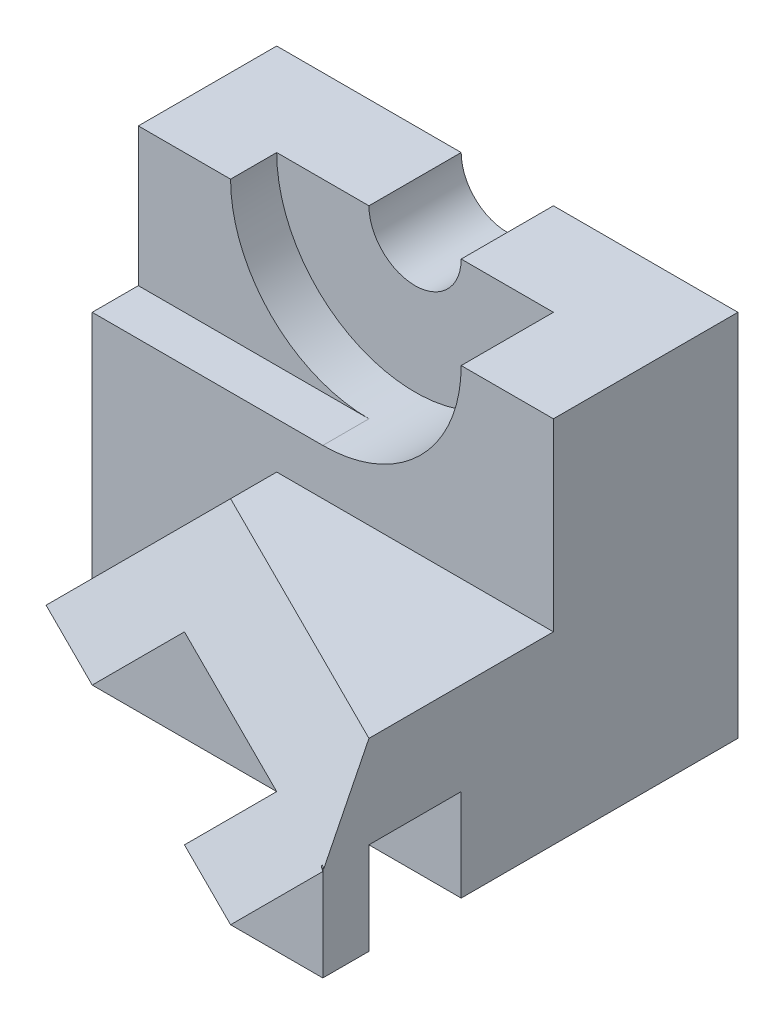
ISO-10303-21;
HEADER;
FILE_DESCRIPTION(('STEP AP214'),'2;1');
FILE_NAME('part.step','',(''),(''),'','','');
FILE_SCHEMA(('AUTOMOTIVE_DESIGN { 1 0 10303 214 1 1 1 1 }'));
ENDSEC;
DATA;
#1=APPLICATION_CONTEXT('core data for automotive mechanical design processes');
#2=APPLICATION_PROTOCOL_DEFINITION('international standard','automotive_design',2000,#1);
#3=PRODUCT_CONTEXT('',#1,'mechanical');
#4=PRODUCT('Part','Part','',(#3));
#5=PRODUCT_RELATED_PRODUCT_CATEGORY('part','',(#4));
#6=PRODUCT_DEFINITION_FORMATION('','',#4);
#7=PRODUCT_DEFINITION_CONTEXT('part definition',#1,'design');
#8=PRODUCT_DEFINITION('design','',#6,#7);
#9=PRODUCT_DEFINITION_SHAPE('','',#8);
#10=(LENGTH_UNIT() NAMED_UNIT(*) SI_UNIT(.MILLI.,.METRE.));
#11=(NAMED_UNIT(*) PLANE_ANGLE_UNIT() SI_UNIT($,.RADIAN.));
#12=(NAMED_UNIT(*) SI_UNIT($,.STERADIAN.) SOLID_ANGLE_UNIT());
#13=UNCERTAINTY_MEASURE_WITH_UNIT(LENGTH_MEASURE(1.E-05),#10,'distance_accuracy_value','');
#14=(GEOMETRIC_REPRESENTATION_CONTEXT(3) GLOBAL_UNCERTAINTY_ASSIGNED_CONTEXT((#13)) GLOBAL_UNIT_ASSIGNED_CONTEXT((#10,
#11,#12)) REPRESENTATION_CONTEXT('',''));
#15=CARTESIAN_POINT('',(0.,0.,0.));
#16=DIRECTION('',(0.,0.,1.));
#17=DIRECTION('',(1.,0.,0.));
#18=AXIS2_PLACEMENT_3D('',#15,#16,#17);
#19=CARTESIAN_POINT('',(0.,0.,90.));
#20=DIRECTION('',(0.,1.,0.));
#21=DIRECTION('',(0.,0.,1.));
#22=AXIS2_PLACEMENT_3D('',#19,#20,#21);
#23=PLANE('',#22);
#24=DIRECTION('',(1.,0.,0.));
#25=VECTOR('',#24,1.);
#26=CARTESIAN_POINT('',(0.,0.,0.));
#27=LINE('',#26,#25);
#28=CARTESIAN_POINT('',(0.,0.,0.));
#29=VERTEX_POINT('',#28);
#30=CARTESIAN_POINT('',(100.,0.,0.));
#31=VERTEX_POINT('',#30);
#32=EDGE_CURVE('E230',#29,#31,#27,.T.);
#33=ORIENTED_EDGE('',*,*,#32,.T.);
#34=DIRECTION('',(0.,0.,-1.));
#35=VECTOR('',#34,1.);
#36=CARTESIAN_POINT('',(100.,0.,90.));
#37=LINE('',#36,#35);
#38=CARTESIAN_POINT('',(100.,0.,60.));
#39=VERTEX_POINT('',#38);
#40=EDGE_CURVE('E292',#39,#31,#37,.T.);
#41=ORIENTED_EDGE('',*,*,#40,.F.);
#42=DIRECTION('',(1.,0.,0.));
#43=VECTOR('',#42,1.);
#44=CARTESIAN_POINT('',(20.,0.,60.));
#45=LINE('',#44,#43);
#46=CARTESIAN_POINT('',(20.,0.,60.));
#47=VERTEX_POINT('',#46);
#48=EDGE_CURVE('E213',#47,#39,#45,.T.);
#49=ORIENTED_EDGE('',*,*,#48,.F.);
#50=DIRECTION('',(-0.894427190999916,0.,-0.447213595499958));
#51=VECTOR('',#50,1.);
#52=CARTESIAN_POINT('',(0.,0.,50.));
#53=LINE('',#52,#51);
#54=CARTESIAN_POINT('',(0.,0.,50.));
#55=VERTEX_POINT('',#54);
#56=EDGE_CURVE('E227',#47,#55,#53,.T.);
#57=ORIENTED_EDGE('',*,*,#56,.T.);
#58=DIRECTION('',(0.,0.,-1.));
#59=VECTOR('',#58,1.);
#60=CARTESIAN_POINT('',(0.,0.,90.));
#61=LINE('',#60,#59);
#62=CARTESIAN_POINT('',(0.,0.,40.));
#63=VERTEX_POINT('',#62);
#64=EDGE_CURVE('E229',#55,#63,#61,.T.);
#65=ORIENTED_EDGE('',*,*,#64,.T.);
#66=EDGE_CURVE('E183',#63,#29,#61,.T.);
#67=ORIENTED_EDGE('',*,*,#66,.T.);
#68=EDGE_LOOP('',(#33,#41,#49,#57,#65,#67));
#69=FACE_BOUND('',#68,.T.);
#70=ADVANCED_FACE('F33',(#69),#23,.F.);
#71=CARTESIAN_POINT('',(20.,0.,50.));
#72=DIRECTION('',(-0.447213595499958,0.,0.894427190999916));
#73=DIRECTION('',(0.894427190999916,0.,0.447213595499958));
#74=AXIS2_PLACEMENT_3D('',#71,#72,#73);
#75=PLANE('',#74);
#76=DIRECTION('',(0.894427190999916,0.,0.447213595499958));
#77=VECTOR('',#76,1.);
#78=CARTESIAN_POINT('',(20.,20.5,50.));
#79=LINE('',#78,#77);
#80=CARTESIAN_POINT('',(99.2916666666667,20.5,89.6458333333334));
#81=VERTEX_POINT('',#80);
#82=CARTESIAN_POINT('',(100.,20.5,90.));
#83=VERTEX_POINT('',#82);
#84=EDGE_CURVE('E159',#81,#83,#79,.T.);
#85=ORIENTED_EDGE('',*,*,#84,.F.);
#86=DIRECTION('',(0.75630289061022,-0.533860863960155,0.37815144530511));
#87=VECTOR('',#86,1.);
#88=CARTESIAN_POINT('',(50.8758040573973,54.6759030183078,65.4379020286986));
#89=LINE('',#88,#87);
#90=CARTESIAN_POINT('',(100.,20.0000000000002,90.));
#91=VERTEX_POINT('',#90);
#92=EDGE_CURVE('E50',#81,#91,#89,.T.);
#93=ORIENTED_EDGE('',*,*,#92,.T.);
#94=DIRECTION('',(0.,-1.,0.));
#95=VECTOR('',#94,1.);
#96=CARTESIAN_POINT('',(100.,20.5,90.));
#97=LINE('',#96,#95);
#98=EDGE_CURVE('E167',#83,#91,#97,.T.);
#99=ORIENTED_EDGE('',*,*,#98,.F.);
#100=EDGE_LOOP('',(#85,#93,#99));
#101=FACE_BOUND('',#100,.T.);
#102=ADVANCED_FACE('F168',(#101),#75,.T.);
#103=CARTESIAN_POINT('',(0.,20.5,0.));
#104=DIRECTION('',(0.,-1.,0.));
#105=DIRECTION('',(0.,0.,-1.));
#106=AXIS2_PLACEMENT_3D('',#103,#104,#105);
#107=PLANE('',#106);
#108=DIRECTION('',(0.,0.,-1.));
#109=VECTOR('',#108,1.);
#110=CARTESIAN_POINT('',(100.,20.5,90.));
#111=LINE('',#110,#109);
#112=CARTESIAN_POINT('',(100.,20.5,89.7500000000001));
#113=VERTEX_POINT('',#112);
#114=EDGE_CURVE('E162',#83,#113,#111,.T.);
#115=ORIENTED_EDGE('',*,*,#114,.T.);
#116=DIRECTION('',(-0.894427190999916,0.,-0.447213595499958));
#117=VECTOR('',#116,1.);
#118=CARTESIAN_POINT('',(-15.9,20.5,31.8));
#119=LINE('',#118,#117);
#120=CARTESIAN_POINT('',(99.2500000000001,20.4999999999999,89.3750000000001));
#121=VERTEX_POINT('',#120);
#122=EDGE_CURVE('E165',#113,#121,#119,.T.);
#123=ORIENTED_EDGE('',*,*,#122,.T.);
#124=DIRECTION('',(-0.152057184253942,0.,-0.988371697650617));
#125=VECTOR('',#124,1.);
#126=CARTESIAN_POINT('',(83.5231213872832,20.5,-12.849710982659));
#127=LINE('',#126,#125);
#128=EDGE_CURVE('E11',#81,#121,#127,.T.);
#129=ORIENTED_EDGE('',*,*,#128,.F.);
#130=ORIENTED_EDGE('',*,*,#84,.T.);
#131=EDGE_LOOP('',(#115,#123,#129,#130));
#132=FACE_BOUND('',#131,.T.);
#133=ADVANCED_FACE('F35',(#132),#107,.F.);
#134=DIRECTION('',(1.,0.,0.));
#135=VECTOR('',#134,1.);
#136=CARTESIAN_POINT('',(60.,0.,80.));
#137=LINE('',#136,#135);
#138=CARTESIAN_POINT('',(60.,0.,80.));
#139=VERTEX_POINT('',#138);
#140=CARTESIAN_POINT('',(100.,0.,80.));
#141=VERTEX_POINT('',#140);
#142=EDGE_CURVE('E164',#139,#141,#137,.T.);
#143=ORIENTED_EDGE('',*,*,#142,.T.);
#144=CARTESIAN_POINT('',(100.,0.,90.));
#145=VERTEX_POINT('',#144);
#146=EDGE_CURVE('E172',#145,#141,#37,.T.);
#147=ORIENTED_EDGE('',*,*,#146,.F.);
#148=DIRECTION('',(1.,0.,0.));
#149=VECTOR('',#148,1.);
#150=CARTESIAN_POINT('',(60.,0.,90.));
#151=LINE('',#150,#149);
#152=CARTESIAN_POINT('',(80.,0.,90.0000000000001));
#153=VERTEX_POINT('',#152);
#154=EDGE_CURVE('E210',#153,#145,#151,.T.);
#155=ORIENTED_EDGE('',*,*,#154,.F.);
#156=DIRECTION('',(0.894427190999916,0.,0.447213595499958));
#157=VECTOR('',#156,1.);
#158=CARTESIAN_POINT('',(60.,0.,80.));
#159=LINE('',#158,#157);
#160=EDGE_CURVE('E197',#139,#153,#159,.T.);
#161=ORIENTED_EDGE('',*,*,#160,.F.);
#162=EDGE_LOOP('',(#143,#147,#155,#161));
#163=FACE_BOUND('',#162,.T.);
#164=ADVANCED_FACE('F384',(#163),#23,.F.);
#165=CARTESIAN_POINT('',(60.,20.,90.));
#166=DIRECTION('',(0.,0.,1.));
#167=DIRECTION('',(1.,0.,0.));
#168=AXIS2_PLACEMENT_3D('',#165,#166,#167);
#169=PLANE('',#168);
#170=DIRECTION('',(0.,1.,0.));
#171=VECTOR('',#170,1.);
#172=CARTESIAN_POINT('',(100.,0.,90.));
#173=LINE('',#172,#171);
#174=EDGE_CURVE('E211',#145,#91,#173,.T.);
#175=ORIENTED_EDGE('',*,*,#174,.T.);
#176=DIRECTION('',(-0.707106781186547,-0.707106781186548,0.));
#177=VECTOR('',#176,1.);
#178=CARTESIAN_POINT('',(80.,0.,90.0000000000001));
#179=LINE('',#178,#177);
#180=EDGE_CURVE('E208',#91,#153,#179,.T.);
#181=ORIENTED_EDGE('',*,*,#180,.T.);
#182=ORIENTED_EDGE('',*,*,#154,.T.);
#183=EDGE_LOOP('',(#175,#181,#182));
#184=FACE_BOUND('',#183,.T.);
#185=ADVANCED_FACE('F390',(#184),#169,.T.);
#186=CARTESIAN_POINT('',(0.,0.,90.));
#187=DIRECTION('',(1.,0.,0.));
#188=DIRECTION('',(0.,0.,-1.));
#189=AXIS2_PLACEMENT_3D('',#186,#187,#188);
#190=PLANE('',#189);
#191=ORIENTED_EDGE('',*,*,#66,.F.);
#192=DIRECTION('',(0.,-1.,0.));
#193=VECTOR('',#192,1.);
#194=CARTESIAN_POINT('',(0.,80.,40.));
#195=LINE('',#194,#193);
#196=CARTESIAN_POINT('',(0.,50.,40.));
#197=VERTEX_POINT('',#196);
#198=EDGE_CURVE('E242',#197,#63,#195,.T.);
#199=ORIENTED_EDGE('',*,*,#198,.F.);
#200=DIRECTION('',(0.,0.,1.));
#201=VECTOR('',#200,1.);
#202=CARTESIAN_POINT('',(0.,50.,30.));
#203=LINE('',#202,#201);
#204=CARTESIAN_POINT('',(0.,50.,30.));
#205=VERTEX_POINT('',#204);
#206=EDGE_CURVE('E248',#205,#197,#203,.T.);
#207=ORIENTED_EDGE('',*,*,#206,.F.);
#208=DIRECTION('',(0.,-1.,0.));
#209=VECTOR('',#208,1.);
#210=CARTESIAN_POINT('',(0.,50.,30.));
#211=LINE('',#210,#209);
#212=CARTESIAN_POINT('',(0.,80.,30.));
#213=VERTEX_POINT('',#212);
#214=EDGE_CURVE('E250',#213,#205,#211,.T.);
#215=ORIENTED_EDGE('',*,*,#214,.F.);
#216=DIRECTION('',(0.,0.,-1.));
#217=VECTOR('',#216,1.);
#218=CARTESIAN_POINT('',(0.,80.,90.));
#219=LINE('',#218,#217);
#220=CARTESIAN_POINT('',(0.,80.,0.));
#221=VERTEX_POINT('',#220);
#222=EDGE_CURVE('E296',#213,#221,#219,.T.);
#223=ORIENTED_EDGE('',*,*,#222,.T.);
#224=DIRECTION('',(0.,-1.,0.));
#225=VECTOR('',#224,1.);
#226=CARTESIAN_POINT('',(0.,0.,0.));
#227=LINE('',#226,#225);
#228=EDGE_CURVE('E37',#221,#29,#227,.T.);
#229=ORIENTED_EDGE('',*,*,#228,.T.);
#230=EDGE_LOOP('',(#191,#199,#207,#215,#223,#229));
#231=FACE_BOUND('',#230,.T.);
#232=ADVANCED_FACE('F351',(#231),#190,.F.);
#233=CARTESIAN_POINT('',(100.,40.,130.));
#234=DIRECTION('',(0.,1.,0.));
#235=DIRECTION('',(0.,0.,1.));
#236=AXIS2_PLACEMENT_3D('',#233,#234,#235);
#237=PLANE('',#236);
#238=DIRECTION('',(0.,0.,-1.));
#239=VECTOR('',#238,1.);
#240=CARTESIAN_POINT('',(40.,40.,134.));
#241=LINE('',#240,#239);
#242=CARTESIAN_POINT('',(40.,40.,50.));
#243=VERTEX_POINT('',#242);
#244=CARTESIAN_POINT('',(40.,40.,40.));
#245=VERTEX_POINT('',#244);
#246=EDGE_CURVE('E234',#243,#245,#241,.T.);
#247=ORIENTED_EDGE('',*,*,#246,.F.);
#248=DIRECTION('',(0.894427190999916,0.,0.447213595499958));
#249=VECTOR('',#248,1.);
#250=CARTESIAN_POINT('',(100.,40.,80.));
#251=LINE('',#250,#249);
#252=CARTESIAN_POINT('',(100.,40.,80.));
#253=VERTEX_POINT('',#252);
#254=EDGE_CURVE('E235',#243,#253,#251,.T.);
#255=ORIENTED_EDGE('',*,*,#254,.T.);
#256=DIRECTION('',(0.,0.,-1.));
#257=VECTOR('',#256,1.);
#258=CARTESIAN_POINT('',(100.,40.,130.));
#259=LINE('',#258,#257);
#260=CARTESIAN_POINT('',(100.,40.,40.));
#261=VERTEX_POINT('',#260);
#262=EDGE_CURVE('E237',#253,#261,#259,.T.);
#263=ORIENTED_EDGE('',*,*,#262,.T.);
#264=DIRECTION('',(1.,0.,0.));
#265=VECTOR('',#264,1.);
#266=CARTESIAN_POINT('',(100.,40.,40.));
#267=LINE('',#266,#265);
#268=EDGE_CURVE('E241',#245,#261,#267,.T.);
#269=ORIENTED_EDGE('',*,*,#268,.F.);
#270=EDGE_LOOP('',(#247,#255,#263,#269));
#271=FACE_BOUND('',#270,.T.);
#272=ADVANCED_FACE('F367',(#271),#237,.T.);
#273=CARTESIAN_POINT('',(0.,80.,90.));
#274=DIRECTION('',(0.,-1.,0.));
#275=DIRECTION('',(0.,0.,-1.));
#276=AXIS2_PLACEMENT_3D('',#273,#274,#275);
#277=PLANE('',#276);
#278=DIRECTION('',(-1.,0.,0.));
#279=VECTOR('',#278,1.);
#280=CARTESIAN_POINT('',(0.,80.,30.));
#281=LINE('',#280,#279);
#282=CARTESIAN_POINT('',(20.,79.9999999999998,30.));
#283=VERTEX_POINT('',#282);
#284=EDGE_CURVE('E247',#283,#213,#281,.T.);
#285=ORIENTED_EDGE('',*,*,#284,.F.);
#286=DIRECTION('',(0.,0.,-1.));
#287=VECTOR('',#286,1.);
#288=CARTESIAN_POINT('',(20.,80.,110.));
#289=LINE('',#288,#287);
#290=CARTESIAN_POINT('',(20.,80.,20.));
#291=VERTEX_POINT('',#290);
#292=EDGE_CURVE('E270',#283,#291,#289,.T.);
#293=ORIENTED_EDGE('',*,*,#292,.T.);
#294=DIRECTION('',(-1.,0.,0.));
#295=VECTOR('',#294,1.);
#296=CARTESIAN_POINT('',(20.,80.,20.));
#297=LINE('',#296,#295);
#298=CARTESIAN_POINT('',(40.,80.,20.));
#299=VERTEX_POINT('',#298);
#300=EDGE_CURVE('E274',#299,#291,#297,.T.);
#301=ORIENTED_EDGE('',*,*,#300,.F.);
#302=DIRECTION('',(0.,0.,-1.));
#303=VECTOR('',#302,1.);
#304=CARTESIAN_POINT('',(40.,80.,90.));
#305=LINE('',#304,#303);
#306=CARTESIAN_POINT('',(40.,80.,0.));
#307=VERTEX_POINT('',#306);
#308=EDGE_CURVE('E277',#299,#307,#305,.T.);
#309=ORIENTED_EDGE('',*,*,#308,.T.);
#310=DIRECTION('',(-1.,0.,0.));
#311=VECTOR('',#310,1.);
#312=CARTESIAN_POINT('',(0.,80.,0.));
#313=LINE('',#312,#311);
#314=EDGE_CURVE('E173',#307,#221,#313,.T.);
#315=ORIENTED_EDGE('',*,*,#314,.T.);
#316=ORIENTED_EDGE('',*,*,#222,.F.);
#317=EDGE_LOOP('',(#285,#293,#301,#309,#315,#316));
#318=FACE_BOUND('',#317,.T.);
#319=ADVANCED_FACE('F329',(#318),#277,.F.);
#320=CARTESIAN_POINT('',(100.,0.,90.));
#321=DIRECTION('',(-1.,0.,0.));
#322=DIRECTION('',(0.,0.,1.));
#323=AXIS2_PLACEMENT_3D('',#320,#321,#322);
#324=PLANE('',#323);
#325=DIRECTION('',(0.,-1.,0.));
#326=VECTOR('',#325,1.);
#327=CARTESIAN_POINT('',(100.,19.999,80.));
#328=LINE('',#327,#326);
#329=CARTESIAN_POINT('',(100.,20.,80.));
#330=VERTEX_POINT('',#329);
#331=EDGE_CURVE('E43',#330,#141,#328,.T.);
#332=ORIENTED_EDGE('',*,*,#331,.F.);
#333=DIRECTION('',(0.,0.,1.));
#334=VECTOR('',#333,1.);
#335=CARTESIAN_POINT('',(100.,20.,80.));
#336=LINE('',#335,#334);
#337=CARTESIAN_POINT('',(100.,20.,60.));
#338=VERTEX_POINT('',#337);
#339=EDGE_CURVE('E403',#338,#330,#336,.T.);
#340=ORIENTED_EDGE('',*,*,#339,.F.);
#341=DIRECTION('',(0.,1.,0.));
#342=VECTOR('',#341,1.);
#343=CARTESIAN_POINT('',(100.,19.999,60.));
#344=LINE('',#343,#342);
#345=EDGE_CURVE('E188',#39,#338,#344,.T.);
#346=ORIENTED_EDGE('',*,*,#345,.F.);
#347=ORIENTED_EDGE('',*,*,#40,.T.);
#348=DIRECTION('',(0.,1.,0.));
#349=VECTOR('',#348,1.);
#350=CARTESIAN_POINT('',(100.,0.,0.));
#351=LINE('',#350,#349);
#352=CARTESIAN_POINT('',(100.,80.,0.));
#353=VERTEX_POINT('',#352);
#354=EDGE_CURVE('E289',#31,#353,#351,.T.);
#355=ORIENTED_EDGE('',*,*,#354,.T.);
#356=DIRECTION('',(0.,0.,-1.));
#357=VECTOR('',#356,1.);
#358=CARTESIAN_POINT('',(100.,80.,90.));
#359=LINE('',#358,#357);
#360=CARTESIAN_POINT('',(100.,80.,40.));
#361=VERTEX_POINT('',#360);
#362=EDGE_CURVE('E291',#361,#353,#359,.T.);
#363=ORIENTED_EDGE('',*,*,#362,.F.);
#364=DIRECTION('',(0.,1.,0.));
#365=VECTOR('',#364,1.);
#366=CARTESIAN_POINT('',(100.,80.,40.));
#367=LINE('',#366,#365);
#368=EDGE_CURVE('E263',#261,#361,#367,.T.);
#369=ORIENTED_EDGE('',*,*,#368,.F.);
#370=ORIENTED_EDGE('',*,*,#262,.F.);
#371=DIRECTION('',(0.,0.894427190999916,-0.447213595499959));
#372=VECTOR('',#371,1.);
#373=CARTESIAN_POINT('',(100.,40.,80.));
#374=LINE('',#373,#372);
#375=EDGE_CURVE('E179',#113,#253,#374,.T.);
#376=ORIENTED_EDGE('',*,*,#375,.F.);
#377=ORIENTED_EDGE('',*,*,#114,.F.);
#378=ORIENTED_EDGE('',*,*,#98,.T.);
#379=ORIENTED_EDGE('',*,*,#174,.F.);
#380=ORIENTED_EDGE('',*,*,#146,.T.);
#381=EDGE_LOOP('',(#332,#340,#346,#347,#355,#363,#369,#370,#376,#377,#378,#379,#380));
#382=FACE_BOUND('',#381,.T.);
#383=ADVANCED_FACE('F176',(#382),#324,.F.);
#384=DIRECTION('',(0.,0.,-1.));
#385=VECTOR('',#384,1.);
#386=CARTESIAN_POINT('',(80.,80.,110.));
#387=LINE('',#386,#385);
#388=CARTESIAN_POINT('',(80.,80.,40.));
#389=VERTEX_POINT('',#388);
#390=CARTESIAN_POINT('',(80.,80.,20.));
#391=VERTEX_POINT('',#390);
#392=EDGE_CURVE('E260',#389,#391,#387,.T.);
#393=ORIENTED_EDGE('',*,*,#392,.F.);
#394=DIRECTION('',(-1.,0.,0.));
#395=VECTOR('',#394,1.);
#396=CARTESIAN_POINT('',(100.,80.,40.));
#397=LINE('',#396,#395);
#398=EDGE_CURVE('E256',#361,#389,#397,.T.);
#399=ORIENTED_EDGE('',*,*,#398,.F.);
#400=ORIENTED_EDGE('',*,*,#362,.T.);
#401=CARTESIAN_POINT('',(60.,80.,0.));
#402=VERTEX_POINT('',#401);
#403=EDGE_CURVE('E293',#353,#402,#313,.T.);
#404=ORIENTED_EDGE('',*,*,#403,.T.);
#405=DIRECTION('',(0.,0.,-1.));
#406=VECTOR('',#405,1.);
#407=CARTESIAN_POINT('',(60.,80.,90.));
#408=LINE('',#407,#406);
#409=CARTESIAN_POINT('',(60.,80.,20.));
#410=VERTEX_POINT('',#409);
#411=EDGE_CURVE('E282',#410,#402,#408,.T.);
#412=ORIENTED_EDGE('',*,*,#411,.F.);
#413=EDGE_CURVE('E261',#391,#410,#297,.T.);
#414=ORIENTED_EDGE('',*,*,#413,.F.);
#415=EDGE_LOOP('',(#393,#399,#400,#404,#412,#414));
#416=FACE_BOUND('',#415,.T.);
#417=ADVANCED_FACE('F315',(#416),#277,.F.);
#418=CARTESIAN_POINT('',(0.,0.,0.));
#419=DIRECTION('',(0.,0.,-1.));
#420=DIRECTION('',(-1.,0.,0.));
#421=AXIS2_PLACEMENT_3D('',#418,#419,#420);
#422=PLANE('',#421);
#423=ORIENTED_EDGE('',*,*,#403,.F.);
#424=ORIENTED_EDGE('',*,*,#354,.F.);
#425=ORIENTED_EDGE('',*,*,#32,.F.);
#426=ORIENTED_EDGE('',*,*,#228,.F.);
#427=ORIENTED_EDGE('',*,*,#314,.F.);
#428=CARTESIAN_POINT('',(50.,80.,0.));
#429=DIRECTION('',(0.,0.,-1.));
#430=DIRECTION('',(-1.,0.,0.));
#431=AXIS2_PLACEMENT_3D('',#428,#429,#430);
#432=CIRCLE('',#431,10.);
#433=EDGE_CURVE('E279',#402,#307,#432,.T.);
#434=ORIENTED_EDGE('',*,*,#433,.F.);
#435=EDGE_LOOP('',(#423,#424,#425,#426,#427,#434));
#436=FACE_BOUND('',#435,.T.);
#437=ADVANCED_FACE('F321',(#436),#422,.T.);
#438=CARTESIAN_POINT('',(50.,80.,90.));
#439=DIRECTION('',(0.,0.,-1.));
#440=DIRECTION('',(-1.,0.,0.));
#441=AXIS2_PLACEMENT_3D('',#438,#439,#440);
#442=CYLINDRICAL_SURFACE('',#441,10.);
#443=ORIENTED_EDGE('',*,*,#308,.F.);
#444=CARTESIAN_POINT('',(50.,80.,20.));
#445=DIRECTION('',(0.,0.,-1.));
#446=DIRECTION('',(-1.,0.,0.));
#447=AXIS2_PLACEMENT_3D('',#444,#445,#446);
#448=CIRCLE('',#447,10.);
#449=EDGE_CURVE('E284',#299,#410,#448,.F.);
#450=ORIENTED_EDGE('',*,*,#449,.T.);
#451=ORIENTED_EDGE('',*,*,#411,.T.);
#452=ORIENTED_EDGE('',*,*,#433,.T.);
#453=EDGE_LOOP('',(#443,#450,#451,#452));
#454=FACE_BOUND('',#453,.T.);
#455=ADVANCED_FACE('F307',(#454),#442,.F.);
#456=CARTESIAN_POINT('',(50.,80.,20.));
#457=DIRECTION('',(0.,0.,-1.));
#458=DIRECTION('',(-1.,0.,0.));
#459=AXIS2_PLACEMENT_3D('',#456,#457,#458);
#460=PLANE('',#459);
#461=ORIENTED_EDGE('',*,*,#300,.T.);
#462=CARTESIAN_POINT('',(50.,80.,20.));
#463=DIRECTION('',(0.,0.,1.));
#464=DIRECTION('',(-1.,0.,0.));
#465=AXIS2_PLACEMENT_3D('',#462,#463,#464);
#466=CIRCLE('',#465,30.);
#467=EDGE_CURVE('E271',#291,#391,#466,.T.);
#468=ORIENTED_EDGE('',*,*,#467,.T.);
#469=ORIENTED_EDGE('',*,*,#413,.T.);
#470=ORIENTED_EDGE('',*,*,#449,.F.);
#471=EDGE_LOOP('',(#461,#468,#469,#470));
#472=FACE_BOUND('',#471,.T.);
#473=ADVANCED_FACE('F332',(#472),#460,.F.);
#474=CARTESIAN_POINT('',(50.,80.,110.));
#475=DIRECTION('',(0.,0.,-1.));
#476=DIRECTION('',(-1.,0.,0.));
#477=AXIS2_PLACEMENT_3D('',#474,#475,#476);
#478=CYLINDRICAL_SURFACE('',#477,30.);
#479=DIRECTION('',(0.,0.,1.));
#480=VECTOR('',#479,1.);
#481=CARTESIAN_POINT('',(50.0000000000002,50.,30.));
#482=LINE('',#481,#480);
#483=CARTESIAN_POINT('',(50.0000000000002,50.,30.));
#484=VERTEX_POINT('',#483);
#485=CARTESIAN_POINT('',(50.0000000000002,50.,40.));
#486=VERTEX_POINT('',#485);
#487=EDGE_CURVE('E257',#484,#486,#482,.T.);
#488=ORIENTED_EDGE('',*,*,#487,.T.);
#489=CARTESIAN_POINT('',(50.,80.,40.));
#490=DIRECTION('',(0.,0.,-1.));
#491=DIRECTION('',(-1.,0.,0.));
#492=AXIS2_PLACEMENT_3D('',#489,#490,#491);
#493=CIRCLE('',#492,30.);
#494=EDGE_CURVE('E206',#389,#486,#493,.T.);
#495=ORIENTED_EDGE('',*,*,#494,.F.);
#496=ORIENTED_EDGE('',*,*,#392,.T.);
#497=ORIENTED_EDGE('',*,*,#467,.F.);
#498=ORIENTED_EDGE('',*,*,#292,.F.);
#499=CARTESIAN_POINT('',(50.,80.,30.));
#500=DIRECTION('',(0.,0.,-1.));
#501=DIRECTION('',(1.,0.,0.));
#502=AXIS2_PLACEMENT_3D('',#499,#500,#501);
#503=CIRCLE('',#502,30.);
#504=EDGE_CURVE('E245',#484,#283,#503,.T.);
#505=ORIENTED_EDGE('',*,*,#504,.F.);
#506=EDGE_LOOP('',(#488,#495,#496,#497,#498,#505));
#507=FACE_BOUND('',#506,.T.);
#508=ADVANCED_FACE('F334',(#507),#478,.F.);
#509=CARTESIAN_POINT('',(0.,0.,40.));
#510=DIRECTION('',(0.,0.,-1.));
#511=DIRECTION('',(-1.,0.,0.));
#512=AXIS2_PLACEMENT_3D('',#509,#510,#511);
#513=PLANE('',#512);
#514=ORIENTED_EDGE('',*,*,#494,.T.);
#515=DIRECTION('',(1.,0.,0.));
#516=VECTOR('',#515,1.);
#517=CARTESIAN_POINT('',(50.0000000000002,50.,40.));
#518=LINE('',#517,#516);
#519=EDGE_CURVE('E254',#197,#486,#518,.T.);
#520=ORIENTED_EDGE('',*,*,#519,.F.);
#521=ORIENTED_EDGE('',*,*,#198,.T.);
#522=DIRECTION('',(0.707106781186548,0.707106781186547,0.));
#523=VECTOR('',#522,1.);
#524=CARTESIAN_POINT('',(40.,40.,40.));
#525=LINE('',#524,#523);
#526=EDGE_CURVE('E238',#63,#245,#525,.T.);
#527=ORIENTED_EDGE('',*,*,#526,.T.);
#528=ORIENTED_EDGE('',*,*,#268,.T.);
#529=ORIENTED_EDGE('',*,*,#368,.T.);
#530=ORIENTED_EDGE('',*,*,#398,.T.);
#531=EDGE_LOOP('',(#514,#520,#521,#527,#528,#529,#530));
#532=FACE_BOUND('',#531,.T.);
#533=ADVANCED_FACE('F360',(#532),#513,.F.);
#534=CARTESIAN_POINT('',(50.0000000000002,50.,30.));
#535=DIRECTION('',(0.,-1.,0.));
#536=DIRECTION('',(0.,0.,-1.));
#537=AXIS2_PLACEMENT_3D('',#534,#535,#536);
#538=PLANE('',#537);
#539=ORIENTED_EDGE('',*,*,#519,.T.);
#540=ORIENTED_EDGE('',*,*,#487,.F.);
#541=DIRECTION('',(1.,0.,0.));
#542=VECTOR('',#541,1.);
#543=CARTESIAN_POINT('',(50.0000000000002,50.,30.));
#544=LINE('',#543,#542);
#545=EDGE_CURVE('E244',#205,#484,#544,.T.);
#546=ORIENTED_EDGE('',*,*,#545,.F.);
#547=ORIENTED_EDGE('',*,*,#206,.T.);
#548=EDGE_LOOP('',(#539,#540,#546,#547));
#549=FACE_BOUND('',#548,.T.);
#550=ADVANCED_FACE('F358',(#549),#538,.F.);
#551=CARTESIAN_POINT('',(50.,80.,30.));
#552=DIRECTION('',(0.,0.,1.));
#553=DIRECTION('',(1.,0.,0.));
#554=AXIS2_PLACEMENT_3D('',#551,#552,#553);
#555=PLANE('',#554);
#556=ORIENTED_EDGE('',*,*,#504,.T.);
#557=ORIENTED_EDGE('',*,*,#284,.T.);
#558=ORIENTED_EDGE('',*,*,#214,.T.);
#559=ORIENTED_EDGE('',*,*,#545,.T.);
#560=EDGE_LOOP('',(#556,#557,#558,#559));
#561=FACE_BOUND('',#560,.T.);
#562=ADVANCED_FACE('F356',(#561),#555,.T.);
#563=CARTESIAN_POINT('',(40.,40.,134.));
#564=DIRECTION('',(-0.707106781186547,0.707106781186548,0.));
#565=DIRECTION('',(-0.707106781186548,-0.707106781186547,0.));
#566=AXIS2_PLACEMENT_3D('',#563,#564,#565);
#567=PLANE('',#566);
#568=ORIENTED_EDGE('',*,*,#64,.F.);
#569=DIRECTION('',(-0.707106781186548,-0.707106781186547,0.));
#570=VECTOR('',#569,1.);
#571=CARTESIAN_POINT('',(40.,40.,50.));
#572=LINE('',#571,#570);
#573=EDGE_CURVE('E192',#243,#55,#572,.T.);
#574=ORIENTED_EDGE('',*,*,#573,.F.);
#575=ORIENTED_EDGE('',*,*,#246,.T.);
#576=ORIENTED_EDGE('',*,*,#526,.F.);
#577=EDGE_LOOP('',(#568,#574,#575,#576));
#578=FACE_BOUND('',#577,.T.);
#579=ADVANCED_FACE('F364',(#578),#567,.T.);
#580=CARTESIAN_POINT('',(0.,0.,60.));
#581=DIRECTION('',(0.,0.,1.));
#582=DIRECTION('',(1.,0.,0.));
#583=AXIS2_PLACEMENT_3D('',#580,#581,#582);
#584=PLANE('',#583);
#585=ORIENTED_EDGE('',*,*,#345,.T.);
#586=DIRECTION('',(1.,0.,0.));
#587=VECTOR('',#586,1.);
#588=CARTESIAN_POINT('',(20.,20.,60.));
#589=LINE('',#588,#587);
#590=CARTESIAN_POINT('',(40.,20.,60.));
#591=VERTEX_POINT('',#590);
#592=EDGE_CURVE('E400',#591,#338,#589,.T.);
#593=ORIENTED_EDGE('',*,*,#592,.F.);
#594=DIRECTION('',(-0.707106781186547,-0.707106781186548,0.));
#595=VECTOR('',#594,1.);
#596=CARTESIAN_POINT('',(20.,0.,60.));
#597=LINE('',#596,#595);
#598=EDGE_CURVE('E232',#591,#47,#597,.T.);
#599=ORIENTED_EDGE('',*,*,#598,.T.);
#600=ORIENTED_EDGE('',*,*,#48,.T.);
#601=EDGE_LOOP('',(#585,#593,#599,#600));
#602=FACE_BOUND('',#601,.T.);
#603=ADVANCED_FACE('F413',(#602),#584,.T.);
#604=CARTESIAN_POINT('',(-16.6666666666667,16.6666666666667,33.3333333333333));
#605=DIRECTION('',(-0.408248290463864,0.408248290463863,0.816496580927726));
#606=DIRECTION('',(0.894427190999916,0.,0.447213595499959));
#607=AXIS2_PLACEMENT_3D('',#604,#605,#606);
#608=PLANE('',#607);
#609=ORIENTED_EDGE('',*,*,#180,.F.);
#610=DIRECTION('',(-0.683763458757828,0.455842305838551,-0.56980288229819));
#611=VECTOR('',#610,1.);
#612=CARTESIAN_POINT('',(100.,20.,90.));
#613=LINE('',#612,#611);
#614=EDGE_CURVE('E55',#91,#121,#613,.T.);
#615=ORIENTED_EDGE('',*,*,#614,.T.);
#616=ORIENTED_EDGE('',*,*,#122,.F.);
#617=ORIENTED_EDGE('',*,*,#375,.T.);
#618=ORIENTED_EDGE('',*,*,#254,.F.);
#619=ORIENTED_EDGE('',*,*,#573,.T.);
#620=ORIENTED_EDGE('',*,*,#56,.F.);
#621=ORIENTED_EDGE('',*,*,#598,.F.);
#622=DIRECTION('',(0.894427190999916,0.,0.447213595499958));
#623=VECTOR('',#622,1.);
#624=CARTESIAN_POINT('',(20.,20.,50.));
#625=LINE('',#624,#623);
#626=CARTESIAN_POINT('',(80.,20.,80.));
#627=VERTEX_POINT('',#626);
#628=EDGE_CURVE('E189',#591,#627,#625,.T.);
#629=ORIENTED_EDGE('',*,*,#628,.T.);
#630=DIRECTION('',(-0.707106781186547,-0.707106781186548,0.));
#631=VECTOR('',#630,1.);
#632=CARTESIAN_POINT('',(80.,20.,80.));
#633=LINE('',#632,#631);
#634=EDGE_CURVE('E191',#627,#139,#633,.T.);
#635=ORIENTED_EDGE('',*,*,#634,.T.);
#636=ORIENTED_EDGE('',*,*,#160,.T.);
#637=EDGE_LOOP('',(#609,#615,#616,#617,#618,#619,#620,#621,#629,#635,#636));
#638=FACE_BOUND('',#637,.T.);
#639=ADVANCED_FACE('F368',(#638),#608,.T.);
#640=CARTESIAN_POINT('',(60.,20.,80.));
#641=DIRECTION('',(0.,0.,-1.));
#642=DIRECTION('',(-1.,0.,0.));
#643=AXIS2_PLACEMENT_3D('',#640,#641,#642);
#644=PLANE('',#643);
#645=ORIENTED_EDGE('',*,*,#634,.F.);
#646=DIRECTION('',(1.,0.,0.));
#647=VECTOR('',#646,1.);
#648=CARTESIAN_POINT('',(20.,20.,80.));
#649=LINE('',#648,#647);
#650=EDGE_CURVE('E288',#627,#330,#649,.T.);
#651=ORIENTED_EDGE('',*,*,#650,.T.);
#652=ORIENTED_EDGE('',*,*,#331,.T.);
#653=ORIENTED_EDGE('',*,*,#142,.F.);
#654=EDGE_LOOP('',(#645,#651,#652,#653));
#655=FACE_BOUND('',#654,.T.);
#656=ADVANCED_FACE('F372',(#655),#644,.T.);
#657=CARTESIAN_POINT('',(99.7958758547681,20.2041241452319,90.4082482904639));
#658=DIRECTION('',(-0.604814736759006,-0.7909115788387,0.0930484210398476));
#659=DIRECTION('',(0.794357832977196,-0.607450107570797,0.));
#660=AXIS2_PLACEMENT_3D('',#657,#658,#659);
#661=PLANE('',#660);
#662=ORIENTED_EDGE('',*,*,#128,.T.);
#663=ORIENTED_EDGE('',*,*,#614,.F.);
#664=ORIENTED_EDGE('',*,*,#92,.F.);
#665=EDGE_LOOP('',(#662,#663,#664));
#666=FACE_BOUND('',#665,.T.);
#667=ADVANCED_FACE('F369',(#666),#661,.T.);
#668=CARTESIAN_POINT('',(20.,20.,80.));
#669=DIRECTION('',(0.,1.,0.));
#670=DIRECTION('',(0.,0.,1.));
#671=AXIS2_PLACEMENT_3D('',#668,#669,#670);
#672=PLANE('',#671);
#673=ORIENTED_EDGE('',*,*,#628,.F.);
#674=ORIENTED_EDGE('',*,*,#592,.T.);
#675=ORIENTED_EDGE('',*,*,#339,.T.);
#676=ORIENTED_EDGE('',*,*,#650,.F.);
#677=EDGE_LOOP('',(#673,#674,#675,#676));
#678=FACE_BOUND('',#677,.T.);
#679=ADVANCED_FACE('F371',(#678),#672,.F.);
#680=CLOSED_SHELL('',(#70,#102,#133,#164,#185,#232,#272,#319,#383,#417,#437,#455,#473,#508,#533,
#550,#562,#579,#603,#639,#656,#667,#679));
#681=MANIFOLD_SOLID_BREP('B2',#680);
#682=ADVANCED_BREP_SHAPE_REPRESENTATION('',(#18,#681),#14);
#683=SHAPE_DEFINITION_REPRESENTATION(#9,#682);
ENDSEC;
END-ISO-10303-21;
